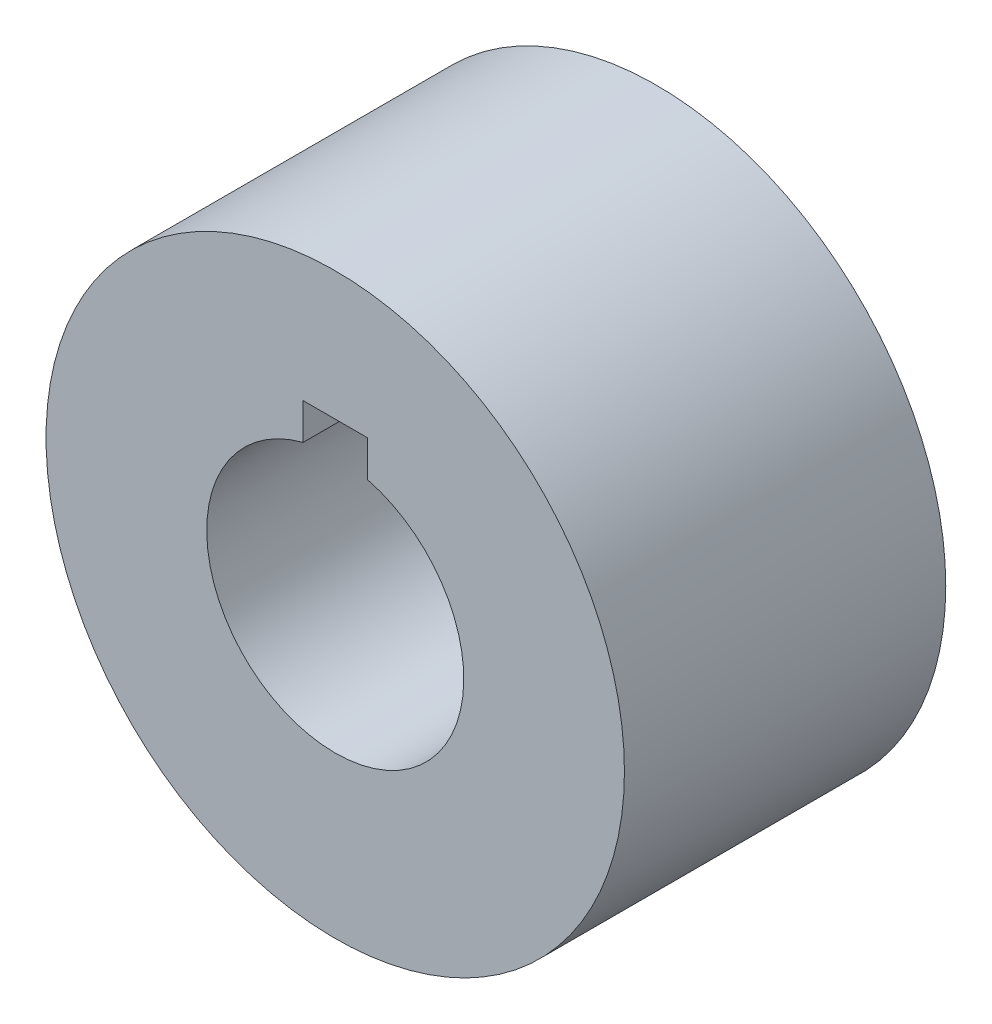
ISO-10303-21;
HEADER;
FILE_DESCRIPTION(('STEP AP214'),'2;1');
FILE_NAME('part.step','',(''),(''),'','','');
FILE_SCHEMA(('AUTOMOTIVE_DESIGN { 1 0 10303 214 1 1 1 1 }'));
ENDSEC;
DATA;
#1=APPLICATION_CONTEXT('core data for automotive mechanical design processes');
#2=APPLICATION_PROTOCOL_DEFINITION('international standard','automotive_design',2000,#1);
#3=PRODUCT_CONTEXT('',#1,'mechanical');
#4=PRODUCT('Part','Part','',(#3));
#5=PRODUCT_RELATED_PRODUCT_CATEGORY('part','',(#4));
#6=PRODUCT_DEFINITION_FORMATION('','',#4);
#7=PRODUCT_DEFINITION_CONTEXT('part definition',#1,'design');
#8=PRODUCT_DEFINITION('design','',#6,#7);
#9=PRODUCT_DEFINITION_SHAPE('','',#8);
#10=(LENGTH_UNIT() NAMED_UNIT(*) SI_UNIT(.MILLI.,.METRE.));
#11=(NAMED_UNIT(*) PLANE_ANGLE_UNIT() SI_UNIT($,.RADIAN.));
#12=(NAMED_UNIT(*) SI_UNIT($,.STERADIAN.) SOLID_ANGLE_UNIT());
#13=UNCERTAINTY_MEASURE_WITH_UNIT(LENGTH_MEASURE(1.E-05),#10,'distance_accuracy_value','');
#14=(GEOMETRIC_REPRESENTATION_CONTEXT(3) GLOBAL_UNCERTAINTY_ASSIGNED_CONTEXT((#13)) GLOBAL_UNIT_ASSIGNED_CONTEXT((#10,
#11,#12)) REPRESENTATION_CONTEXT('',''));
#15=CARTESIAN_POINT('',(0.,0.,0.));
#16=DIRECTION('',(0.,0.,1.));
#17=DIRECTION('',(1.,0.,0.));
#18=AXIS2_PLACEMENT_3D('',#15,#16,#17);
#19=CARTESIAN_POINT('',(0.,0.,10.));
#20=DIRECTION('',(0.,0.,1.));
#21=DIRECTION('',(1.,0.,0.));
#22=AXIS2_PLACEMENT_3D('',#19,#20,#21);
#23=PLANE('',#22);
#24=CARTESIAN_POINT('',(0.,0.,10.));
#25=DIRECTION('',(0.,0.,1.));
#26=DIRECTION('',(1.,0.,0.));
#27=AXIS2_PLACEMENT_3D('',#24,#25,#26);
#28=CIRCLE('',#27,9.);
#29=CARTESIAN_POINT('',(9.,0.,10.));
#30=VERTEX_POINT('',#29);
#31=EDGE_CURVE('E11',#30,#30,#28,.T.);
#32=ORIENTED_EDGE('',*,*,#31,.T.);
#33=EDGE_LOOP('',(#32));
#34=FACE_BOUND('',#33,.T.);
#35=DIRECTION('',(-1.,0.,0.));
#36=VECTOR('',#35,1.);
#37=CARTESIAN_POINT('',(-1.,5.,10.));
#38=LINE('',#37,#36);
#39=CARTESIAN_POINT('',(1.,5.,10.));
#40=VERTEX_POINT('',#39);
#41=CARTESIAN_POINT('',(-1.,5.,10.));
#42=VERTEX_POINT('',#41);
#43=EDGE_CURVE('E90',#40,#42,#38,.T.);
#44=ORIENTED_EDGE('',*,*,#43,.F.);
#45=DIRECTION('',(0.,1.,0.));
#46=VECTOR('',#45,1.);
#47=CARTESIAN_POINT('',(1.,5.,10.));
#48=LINE('',#47,#46);
#49=CARTESIAN_POINT('',(1.,3.87298334620742,10.));
#50=VERTEX_POINT('',#49);
#51=EDGE_CURVE('E81',#50,#40,#48,.T.);
#52=ORIENTED_EDGE('',*,*,#51,.F.);
#53=CARTESIAN_POINT('',(0.,0.,10.));
#54=DIRECTION('',(0.,0.,1.));
#55=DIRECTION('',(1.,0.,0.));
#56=AXIS2_PLACEMENT_3D('',#53,#54,#55);
#57=CIRCLE('',#56,4.);
#58=CARTESIAN_POINT('',(-1.,3.87298334620742,10.));
#59=VERTEX_POINT('',#58);
#60=EDGE_CURVE('E106',#59,#50,#57,.T.);
#61=ORIENTED_EDGE('',*,*,#60,.F.);
#62=DIRECTION('',(0.,-1.,0.));
#63=VECTOR('',#62,1.);
#64=CARTESIAN_POINT('',(-1.,5.,10.));
#65=LINE('',#64,#63);
#66=EDGE_CURVE('E102',#42,#59,#65,.T.);
#67=ORIENTED_EDGE('',*,*,#66,.F.);
#68=EDGE_LOOP('',(#44,#52,#61,#67));
#69=FACE_BOUND('',#68,.T.);
#70=ADVANCED_FACE('F39',(#34,#69),#23,.T.);
#71=CARTESIAN_POINT('',(0.,0.,0.));
#72=DIRECTION('',(0.,0.,1.));
#73=DIRECTION('',(1.,0.,0.));
#74=AXIS2_PLACEMENT_3D('',#71,#72,#73);
#75=PLANE('',#74);
#76=CARTESIAN_POINT('',(0.,0.,0.));
#77=DIRECTION('',(0.,0.,1.));
#78=DIRECTION('',(1.,0.,0.));
#79=AXIS2_PLACEMENT_3D('',#76,#77,#78);
#80=CIRCLE('',#79,9.);
#81=CARTESIAN_POINT('',(9.,0.,0.));
#82=VERTEX_POINT('',#81);
#83=EDGE_CURVE('E43',#82,#82,#80,.T.);
#84=ORIENTED_EDGE('',*,*,#83,.F.);
#85=EDGE_LOOP('',(#84));
#86=FACE_BOUND('',#85,.T.);
#87=DIRECTION('',(0.,1.,0.));
#88=VECTOR('',#87,1.);
#89=CARTESIAN_POINT('',(1.,5.,0.));
#90=LINE('',#89,#88);
#91=CARTESIAN_POINT('',(1.,3.87298334620742,0.));
#92=VERTEX_POINT('',#91);
#93=CARTESIAN_POINT('',(1.,5.,0.));
#94=VERTEX_POINT('',#93);
#95=EDGE_CURVE('E63',#92,#94,#90,.T.);
#96=ORIENTED_EDGE('',*,*,#95,.T.);
#97=DIRECTION('',(-1.,0.,0.));
#98=VECTOR('',#97,1.);
#99=CARTESIAN_POINT('',(-1.,5.,0.));
#100=LINE('',#99,#98);
#101=CARTESIAN_POINT('',(-1.,5.,0.));
#102=VERTEX_POINT('',#101);
#103=EDGE_CURVE('E97',#94,#102,#100,.T.);
#104=ORIENTED_EDGE('',*,*,#103,.T.);
#105=DIRECTION('',(0.,-1.,0.));
#106=VECTOR('',#105,1.);
#107=CARTESIAN_POINT('',(-1.,5.,0.));
#108=LINE('',#107,#106);
#109=CARTESIAN_POINT('',(-1.,3.87298334620742,0.));
#110=VERTEX_POINT('',#109);
#111=EDGE_CURVE('E115',#102,#110,#108,.T.);
#112=ORIENTED_EDGE('',*,*,#111,.T.);
#113=CARTESIAN_POINT('',(0.,0.,0.));
#114=DIRECTION('',(0.,0.,1.));
#115=DIRECTION('',(1.,0.,0.));
#116=AXIS2_PLACEMENT_3D('',#113,#114,#115);
#117=CIRCLE('',#116,4.);
#118=EDGE_CURVE('E91',#110,#92,#117,.T.);
#119=ORIENTED_EDGE('',*,*,#118,.T.);
#120=EDGE_LOOP('',(#96,#104,#112,#119));
#121=FACE_BOUND('',#120,.T.);
#122=ADVANCED_FACE('F131',(#86,#121),#75,.F.);
#123=CARTESIAN_POINT('',(0.,0.,10.));
#124=DIRECTION('',(0.,0.,-1.));
#125=DIRECTION('',(-1.,0.,0.));
#126=AXIS2_PLACEMENT_3D('',#123,#124,#125);
#127=CYLINDRICAL_SURFACE('',#126,9.);
#128=ORIENTED_EDGE('',*,*,#31,.F.);
#129=EDGE_LOOP('',(#128));
#130=FACE_BOUND('',#129,.T.);
#131=ORIENTED_EDGE('',*,*,#83,.T.);
#132=EDGE_LOOP('',(#131));
#133=FACE_BOUND('',#132,.T.);
#134=ADVANCED_FACE('F41',(#130,#133),#127,.T.);
#135=CARTESIAN_POINT('',(1.,5.,10.));
#136=DIRECTION('',(-1.,0.,0.));
#137=DIRECTION('',(0.,0.,1.));
#138=AXIS2_PLACEMENT_3D('',#135,#136,#137);
#139=PLANE('',#138);
#140=ORIENTED_EDGE('',*,*,#95,.F.);
#141=DIRECTION('',(0.,0.,-1.));
#142=VECTOR('',#141,1.);
#143=CARTESIAN_POINT('',(1.,3.87298334620742,10.));
#144=LINE('',#143,#142);
#145=EDGE_CURVE('E85',#50,#92,#144,.T.);
#146=ORIENTED_EDGE('',*,*,#145,.F.);
#147=ORIENTED_EDGE('',*,*,#51,.T.);
#148=DIRECTION('',(0.,0.,-1.));
#149=VECTOR('',#148,1.);
#150=CARTESIAN_POINT('',(1.,5.,10.));
#151=LINE('',#150,#149);
#152=EDGE_CURVE('E84',#40,#94,#151,.T.);
#153=ORIENTED_EDGE('',*,*,#152,.T.);
#154=EDGE_LOOP('',(#140,#146,#147,#153));
#155=FACE_BOUND('',#154,.T.);
#156=ADVANCED_FACE('F83',(#155),#139,.T.);
#157=CARTESIAN_POINT('',(-1.,5.,10.));
#158=DIRECTION('',(0.,-1.,0.));
#159=DIRECTION('',(0.,0.,-1.));
#160=AXIS2_PLACEMENT_3D('',#157,#158,#159);
#161=PLANE('',#160);
#162=ORIENTED_EDGE('',*,*,#103,.F.);
#163=ORIENTED_EDGE('',*,*,#152,.F.);
#164=ORIENTED_EDGE('',*,*,#43,.T.);
#165=DIRECTION('',(0.,0.,-1.));
#166=VECTOR('',#165,1.);
#167=CARTESIAN_POINT('',(-1.,5.,10.));
#168=LINE('',#167,#166);
#169=EDGE_CURVE('E99',#42,#102,#168,.T.);
#170=ORIENTED_EDGE('',*,*,#169,.T.);
#171=EDGE_LOOP('',(#162,#163,#164,#170));
#172=FACE_BOUND('',#171,.T.);
#173=ADVANCED_FACE('F94',(#172),#161,.T.);
#174=CARTESIAN_POINT('',(-1.,5.,10.));
#175=DIRECTION('',(1.,0.,0.));
#176=DIRECTION('',(0.,0.,-1.));
#177=AXIS2_PLACEMENT_3D('',#174,#175,#176);
#178=PLANE('',#177);
#179=ORIENTED_EDGE('',*,*,#111,.F.);
#180=ORIENTED_EDGE('',*,*,#169,.F.);
#181=ORIENTED_EDGE('',*,*,#66,.T.);
#182=DIRECTION('',(0.,0.,-1.));
#183=VECTOR('',#182,1.);
#184=CARTESIAN_POINT('',(-1.,3.87298334620742,10.));
#185=LINE('',#184,#183);
#186=EDGE_CURVE('E55',#59,#110,#185,.T.);
#187=ORIENTED_EDGE('',*,*,#186,.T.);
#188=EDGE_LOOP('',(#179,#180,#181,#187));
#189=FACE_BOUND('',#188,.T.);
#190=ADVANCED_FACE('F129',(#189),#178,.T.);
#191=CARTESIAN_POINT('',(0.,0.,10.));
#192=DIRECTION('',(0.,0.,-1.));
#193=DIRECTION('',(-1.,0.,0.));
#194=AXIS2_PLACEMENT_3D('',#191,#192,#193);
#195=CYLINDRICAL_SURFACE('',#194,4.);
#196=ORIENTED_EDGE('',*,*,#118,.F.);
#197=ORIENTED_EDGE('',*,*,#186,.F.);
#198=ORIENTED_EDGE('',*,*,#60,.T.);
#199=ORIENTED_EDGE('',*,*,#145,.T.);
#200=EDGE_LOOP('',(#196,#197,#198,#199));
#201=FACE_BOUND('',#200,.T.);
#202=ADVANCED_FACE('F132',(#201),#195,.F.);
#203=CLOSED_SHELL('',(#70,#122,#134,#156,#173,#190,#202));
#204=MANIFOLD_SOLID_BREP('B2',#203);
#205=ADVANCED_BREP_SHAPE_REPRESENTATION('',(#18,#204),#14);
#206=SHAPE_DEFINITION_REPRESENTATION(#9,#205);
ENDSEC;
END-ISO-10303-21;
